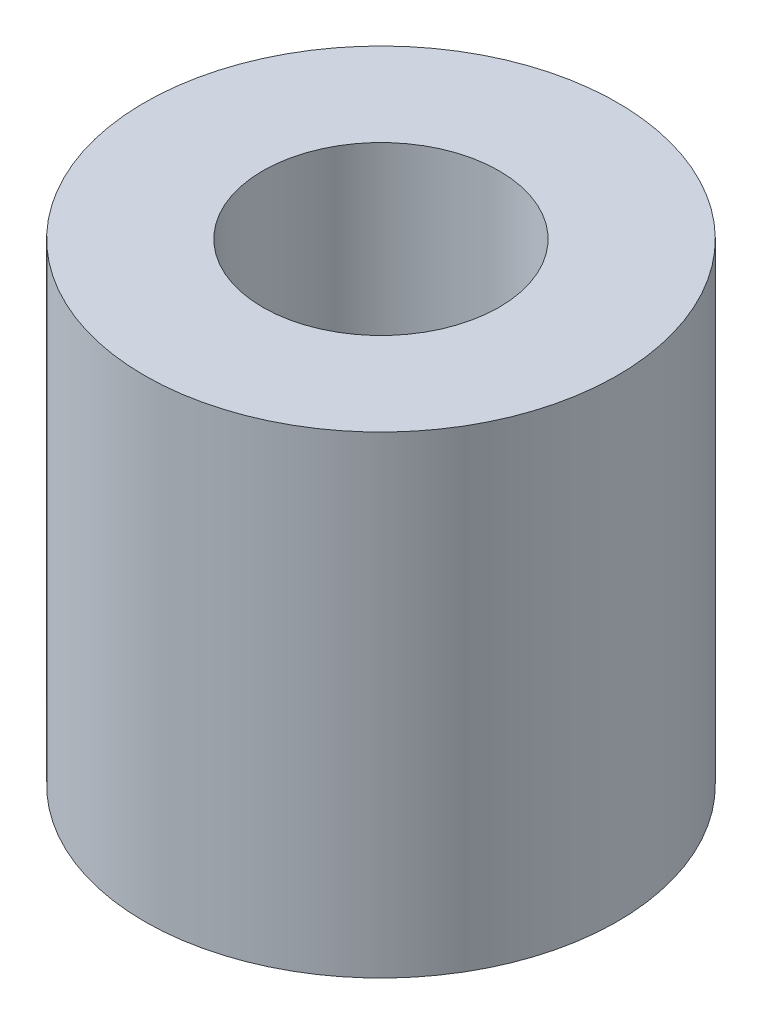
ISO-10303-21;
HEADER;
FILE_DESCRIPTION(('STEP AP214'),'2;1');
FILE_NAME('part.step','',(''),(''),'','','');
FILE_SCHEMA(('AUTOMOTIVE_DESIGN { 1 0 10303 214 1 1 1 1 }'));
ENDSEC;
DATA;
#1=APPLICATION_CONTEXT('core data for automotive mechanical design processes');
#2=APPLICATION_PROTOCOL_DEFINITION('international standard','automotive_design',2000,#1);
#3=PRODUCT_CONTEXT('',#1,'mechanical');
#4=PRODUCT('Part','Part','',(#3));
#5=PRODUCT_RELATED_PRODUCT_CATEGORY('part','',(#4));
#6=PRODUCT_DEFINITION_FORMATION('','',#4);
#7=PRODUCT_DEFINITION_CONTEXT('part definition',#1,'design');
#8=PRODUCT_DEFINITION('design','',#6,#7);
#9=PRODUCT_DEFINITION_SHAPE('','',#8);
#10=(LENGTH_UNIT() NAMED_UNIT(*) SI_UNIT(.MILLI.,.METRE.));
#11=(NAMED_UNIT(*) PLANE_ANGLE_UNIT() SI_UNIT($,.RADIAN.));
#12=(NAMED_UNIT(*) SI_UNIT($,.STERADIAN.) SOLID_ANGLE_UNIT());
#13=UNCERTAINTY_MEASURE_WITH_UNIT(LENGTH_MEASURE(1.E-05),#10,'distance_accuracy_value','');
#14=(GEOMETRIC_REPRESENTATION_CONTEXT(3) GLOBAL_UNCERTAINTY_ASSIGNED_CONTEXT((#13)) GLOBAL_UNIT_ASSIGNED_CONTEXT((#10,
#11,#12)) REPRESENTATION_CONTEXT('',''));
#15=CARTESIAN_POINT('',(0.,0.,0.));
#16=DIRECTION('',(0.,0.,1.));
#17=DIRECTION('',(1.,0.,0.));
#18=AXIS2_PLACEMENT_3D('',#15,#16,#17);
#19=CARTESIAN_POINT('',(0.,20.,0.));
#20=DIRECTION('',(0.,1.,0.));
#21=DIRECTION('',(0.,0.,1.));
#22=AXIS2_PLACEMENT_3D('',#19,#20,#21);
#23=PLANE('',#22);
#24=CARTESIAN_POINT('',(0.,20.,0.));
#25=DIRECTION('',(0.,1.,0.));
#26=DIRECTION('',(0.,0.,1.));
#27=AXIS2_PLACEMENT_3D('',#24,#25,#26);
#28=CIRCLE('',#27,10.);
#29=CARTESIAN_POINT('',(0.,20.,10.));
#30=VERTEX_POINT('',#29);
#31=EDGE_CURVE('E10',#30,#30,#28,.T.);
#32=ORIENTED_EDGE('',*,*,#31,.T.);
#33=EDGE_LOOP('',(#32));
#34=FACE_BOUND('',#33,.T.);
#35=CARTESIAN_POINT('',(0.,20.,0.));
#36=DIRECTION('',(0.,1.,0.));
#37=DIRECTION('',(0.,0.,1.));
#38=AXIS2_PLACEMENT_3D('',#35,#36,#37);
#39=CIRCLE('',#38,5.);
#40=CARTESIAN_POINT('',(0.,20.,5.));
#41=VERTEX_POINT('',#40);
#42=EDGE_CURVE('E40',#41,#41,#39,.T.);
#43=ORIENTED_EDGE('',*,*,#42,.F.);
#44=EDGE_LOOP('',(#43));
#45=FACE_BOUND('',#44,.T.);
#46=ADVANCED_FACE('F29',(#34,#45),#23,.T.);
#47=CARTESIAN_POINT('',(0.,0.,0.));
#48=DIRECTION('',(0.,1.,0.));
#49=DIRECTION('',(0.,0.,1.));
#50=AXIS2_PLACEMENT_3D('',#47,#48,#49);
#51=PLANE('',#50);
#52=CARTESIAN_POINT('',(0.,0.,0.));
#53=DIRECTION('',(0.,1.,0.));
#54=DIRECTION('',(0.,0.,1.));
#55=AXIS2_PLACEMENT_3D('',#52,#53,#54);
#56=CIRCLE('',#55,10.);
#57=CARTESIAN_POINT('',(0.,0.,10.));
#58=VERTEX_POINT('',#57);
#59=EDGE_CURVE('E33',#58,#58,#56,.T.);
#60=ORIENTED_EDGE('',*,*,#59,.F.);
#61=EDGE_LOOP('',(#60));
#62=FACE_BOUND('',#61,.T.);
#63=CARTESIAN_POINT('',(0.,0.,0.));
#64=DIRECTION('',(0.,1.,0.));
#65=DIRECTION('',(0.,0.,1.));
#66=AXIS2_PLACEMENT_3D('',#63,#64,#65);
#67=CIRCLE('',#66,5.);
#68=CARTESIAN_POINT('',(0.,0.,5.));
#69=VERTEX_POINT('',#68);
#70=EDGE_CURVE('E42',#69,#69,#67,.T.);
#71=ORIENTED_EDGE('',*,*,#70,.T.);
#72=EDGE_LOOP('',(#71));
#73=FACE_BOUND('',#72,.T.);
#74=ADVANCED_FACE('F52',(#62,#73),#51,.F.);
#75=CARTESIAN_POINT('',(0.,20.,0.));
#76=DIRECTION('',(0.,-1.,0.));
#77=DIRECTION('',(0.,0.,-1.));
#78=AXIS2_PLACEMENT_3D('',#75,#76,#77);
#79=CYLINDRICAL_SURFACE('',#78,10.);
#80=ORIENTED_EDGE('',*,*,#31,.F.);
#81=EDGE_LOOP('',(#80));
#82=FACE_BOUND('',#81,.T.);
#83=ORIENTED_EDGE('',*,*,#59,.T.);
#84=EDGE_LOOP('',(#83));
#85=FACE_BOUND('',#84,.T.);
#86=ADVANCED_FACE('F31',(#82,#85),#79,.T.);
#87=CARTESIAN_POINT('',(0.,20.,0.));
#88=DIRECTION('',(0.,-1.,0.));
#89=DIRECTION('',(0.,0.,-1.));
#90=AXIS2_PLACEMENT_3D('',#87,#88,#89);
#91=CYLINDRICAL_SURFACE('',#90,5.);
#92=ORIENTED_EDGE('',*,*,#42,.T.);
#93=EDGE_LOOP('',(#92));
#94=FACE_BOUND('',#93,.T.);
#95=ORIENTED_EDGE('',*,*,#70,.F.);
#96=EDGE_LOOP('',(#95));
#97=FACE_BOUND('',#96,.T.);
#98=ADVANCED_FACE('F48',(#94,#97),#91,.F.);
#99=CLOSED_SHELL('',(#46,#74,#86,#98));
#100=MANIFOLD_SOLID_BREP('B2',#99);
#101=ADVANCED_BREP_SHAPE_REPRESENTATION('',(#18,#100),#14);
#102=SHAPE_DEFINITION_REPRESENTATION(#9,#101);
ENDSEC;
END-ISO-10303-21;
